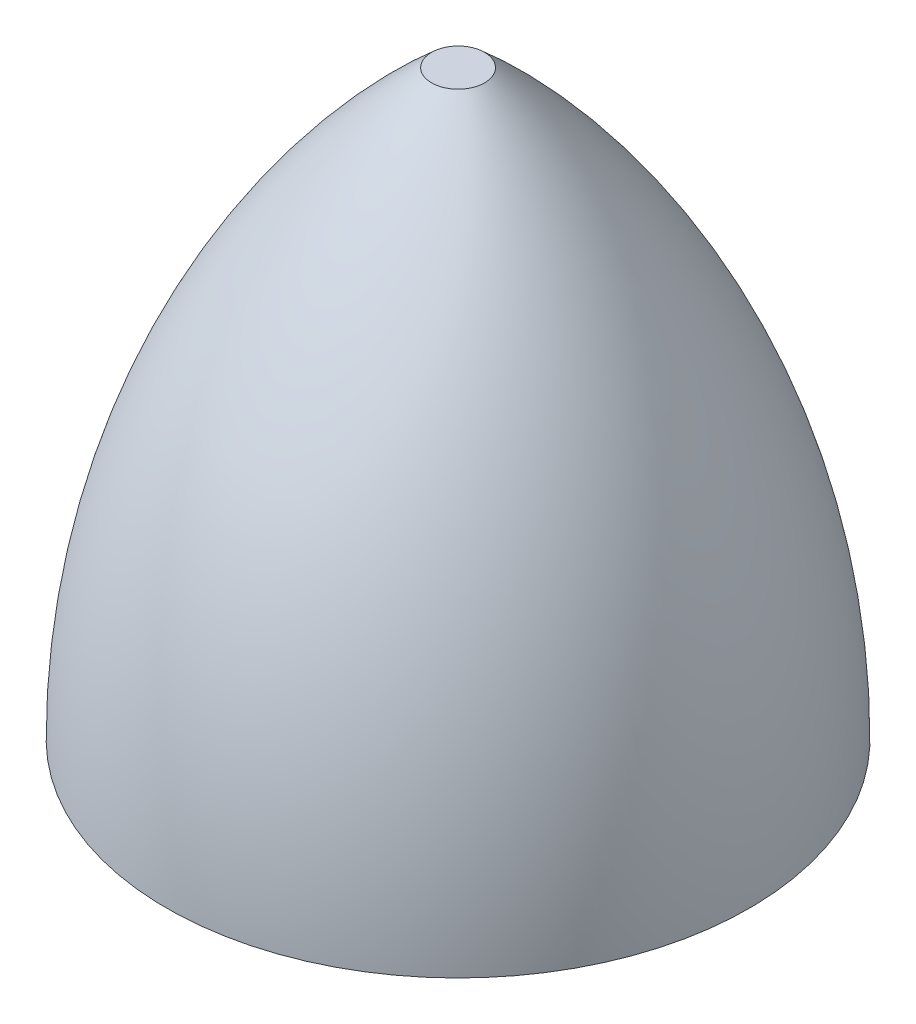
ISO-10303-21;
HEADER;
FILE_DESCRIPTION(('STEP AP214'),'2;1');
FILE_NAME('part.step','',(''),(''),'','','');
FILE_SCHEMA(('AUTOMOTIVE_DESIGN { 1 0 10303 214 1 1 1 1 }'));
ENDSEC;
DATA;
#1=APPLICATION_CONTEXT('core data for automotive mechanical design processes');
#2=APPLICATION_PROTOCOL_DEFINITION('international standard','automotive_design',2000,#1);
#3=PRODUCT_CONTEXT('',#1,'mechanical');
#4=PRODUCT('Part','Part','',(#3));
#5=PRODUCT_RELATED_PRODUCT_CATEGORY('part','',(#4));
#6=PRODUCT_DEFINITION_FORMATION('','',#4);
#7=PRODUCT_DEFINITION_CONTEXT('part definition',#1,'design');
#8=PRODUCT_DEFINITION('design','',#6,#7);
#9=PRODUCT_DEFINITION_SHAPE('','',#8);
#10=(LENGTH_UNIT() NAMED_UNIT(*) SI_UNIT(.MILLI.,.METRE.));
#11=(NAMED_UNIT(*) PLANE_ANGLE_UNIT() SI_UNIT($,.RADIAN.));
#12=(NAMED_UNIT(*) SI_UNIT($,.STERADIAN.) SOLID_ANGLE_UNIT());
#13=UNCERTAINTY_MEASURE_WITH_UNIT(LENGTH_MEASURE(1.E-05),#10,'distance_accuracy_value','');
#14=(GEOMETRIC_REPRESENTATION_CONTEXT(3) GLOBAL_UNCERTAINTY_ASSIGNED_CONTEXT((#13)) GLOBAL_UNIT_ASSIGNED_CONTEXT((#10,
#11,#12)) REPRESENTATION_CONTEXT('',''));
#15=CARTESIAN_POINT('',(0.,0.,0.));
#16=DIRECTION('',(0.,0.,1.));
#17=DIRECTION('',(1.,0.,0.));
#18=AXIS2_PLACEMENT_3D('',#15,#16,#17);
#19=CARTESIAN_POINT('',(0.,0.,0.));
#20=DIRECTION('',(0.,-1.,0.));
#21=DIRECTION('',(0.,0.,-1.));
#22=AXIS2_PLACEMENT_3D('',#19,#20,#21);
#23=PLANE('',#22);
#24=CARTESIAN_POINT('',(0.,0.,0.));
#25=DIRECTION('',(0.,-1.,0.));
#26=DIRECTION('',(0.,0.,-1.));
#27=AXIS2_PLACEMENT_3D('',#24,#25,#26);
#28=CIRCLE('',#27,110.);
#29=CARTESIAN_POINT('',(0.,0.,-110.));
#30=VERTEX_POINT('',#29);
#31=EDGE_CURVE('E10',#30,#30,#28,.T.);
#32=ORIENTED_EDGE('',*,*,#31,.T.);
#33=EDGE_LOOP('',(#32));
#34=FACE_BOUND('',#33,.T.);
#35=ADVANCED_FACE('F32',(#34),#23,.T.);
#36=CARTESIAN_POINT('',(0.,0.,0.));
#37=DIRECTION('',(0.,-1.,0.));
#38=DIRECTION('',(0.,0.,-1.));
#39=AXIS2_PLACEMENT_3D('',#36,#37,#38);
#40=DEGENERATE_TOROIDAL_SURFACE('',#39,182.,292.,.F.);
#41=CARTESIAN_POINT('',(0.,220.,0.));
#42=DIRECTION('',(0.,-1.,0.));
#43=DIRECTION('',(0.,0.,-1.));
#44=AXIS2_PLACEMENT_3D('',#41,#42,#43);
#45=CIRCLE('',#44,9.99999999999998);
#46=CARTESIAN_POINT('',(0.,220.,-9.99999999999998));
#47=VERTEX_POINT('',#46);
#48=EDGE_CURVE('E38',#47,#47,#45,.T.);
#49=ORIENTED_EDGE('',*,*,#48,.T.);
#50=EDGE_LOOP('',(#49));
#51=FACE_BOUND('',#50,.T.);
#52=ORIENTED_EDGE('',*,*,#31,.F.);
#53=EDGE_LOOP('',(#52));
#54=FACE_BOUND('',#53,.T.);
#55=ADVANCED_FACE('F44',(#51,#54),#40,.F.);
#56=CARTESIAN_POINT('',(10.,220.,0.));
#57=DIRECTION('',(0.,1.,0.));
#58=DIRECTION('',(0.,0.,1.));
#59=AXIS2_PLACEMENT_3D('',#56,#57,#58);
#60=PLANE('',#59);
#61=ORIENTED_EDGE('',*,*,#48,.F.);
#62=EDGE_LOOP('',(#61));
#63=FACE_BOUND('',#62,.T.);
#64=ADVANCED_FACE('F47',(#63),#60,.T.);
#65=CLOSED_SHELL('',(#35,#55,#64));
#66=MANIFOLD_SOLID_BREP('B2',#65);
#67=ADVANCED_BREP_SHAPE_REPRESENTATION('',(#18,#66),#14);
#68=SHAPE_DEFINITION_REPRESENTATION(#9,#67);
ENDSEC;
END-ISO-10303-21;
